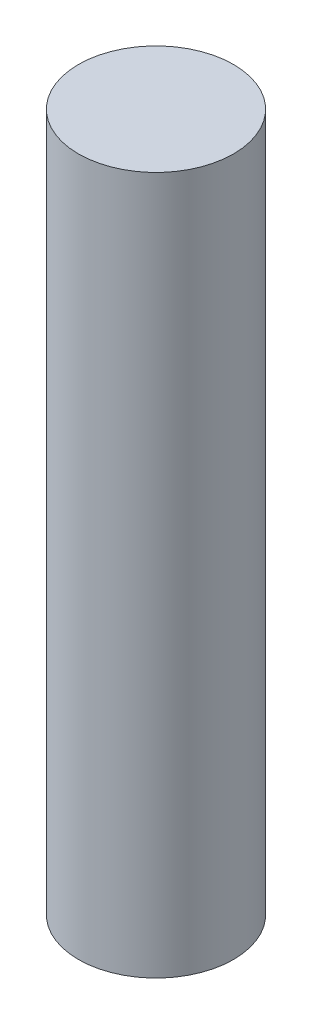
ISO-10303-21;
HEADER;
FILE_DESCRIPTION(('STEP AP214'),'2;1');
FILE_NAME('part.step','',(''),(''),'','','');
FILE_SCHEMA(('AUTOMOTIVE_DESIGN { 1 0 10303 214 1 1 1 1 }'));
ENDSEC;
DATA;
#1=APPLICATION_CONTEXT('core data for automotive mechanical design processes');
#2=APPLICATION_PROTOCOL_DEFINITION('international standard','automotive_design',2000,#1);
#3=PRODUCT_CONTEXT('',#1,'mechanical');
#4=PRODUCT('Part','Part','',(#3));
#5=PRODUCT_RELATED_PRODUCT_CATEGORY('part','',(#4));
#6=PRODUCT_DEFINITION_FORMATION('','',#4);
#7=PRODUCT_DEFINITION_CONTEXT('part definition',#1,'design');
#8=PRODUCT_DEFINITION('design','',#6,#7);
#9=PRODUCT_DEFINITION_SHAPE('','',#8);
#10=(LENGTH_UNIT() NAMED_UNIT(*) SI_UNIT(.MILLI.,.METRE.));
#11=(NAMED_UNIT(*) PLANE_ANGLE_UNIT() SI_UNIT($,.RADIAN.));
#12=(NAMED_UNIT(*) SI_UNIT($,.STERADIAN.) SOLID_ANGLE_UNIT());
#13=UNCERTAINTY_MEASURE_WITH_UNIT(LENGTH_MEASURE(1.E-05),#10,'distance_accuracy_value','');
#14=(GEOMETRIC_REPRESENTATION_CONTEXT(3) GLOBAL_UNCERTAINTY_ASSIGNED_CONTEXT((#13)) GLOBAL_UNIT_ASSIGNED_CONTEXT((#10,
#11,#12)) REPRESENTATION_CONTEXT('',''));
#15=CARTESIAN_POINT('',(0.,0.,0.));
#16=DIRECTION('',(0.,0.,1.));
#17=DIRECTION('',(1.,0.,0.));
#18=AXIS2_PLACEMENT_3D('',#15,#16,#17);
#19=CARTESIAN_POINT('',(0.,114.3,0.));
#20=DIRECTION('',(0.,-1.,0.));
#21=DIRECTION('',(0.,0.,-1.));
#22=AXIS2_PLACEMENT_3D('',#19,#20,#21);
#23=CYLINDRICAL_SURFACE('',#22,12.7);
#24=CARTESIAN_POINT('',(0.,114.3,0.));
#25=DIRECTION('',(0.,1.,0.));
#26=DIRECTION('',(0.,0.,1.));
#27=AXIS2_PLACEMENT_3D('',#24,#25,#26);
#28=CIRCLE('',#27,12.7);
#29=CARTESIAN_POINT('',(0.,114.3,12.7));
#30=VERTEX_POINT('',#29);
#31=EDGE_CURVE('E10',#30,#30,#28,.T.);
#32=ORIENTED_EDGE('',*,*,#31,.F.);
#33=EDGE_LOOP('',(#32));
#34=FACE_BOUND('',#33,.T.);
#35=CARTESIAN_POINT('',(0.,0.,0.));
#36=DIRECTION('',(0.,1.,0.));
#37=DIRECTION('',(0.,0.,1.));
#38=AXIS2_PLACEMENT_3D('',#35,#36,#37);
#39=CIRCLE('',#38,12.7);
#40=CARTESIAN_POINT('',(0.,0.,12.7));
#41=VERTEX_POINT('',#40);
#42=EDGE_CURVE('E44',#41,#41,#39,.T.);
#43=ORIENTED_EDGE('',*,*,#42,.T.);
#44=EDGE_LOOP('',(#43));
#45=FACE_BOUND('',#44,.T.);
#46=ADVANCED_FACE('F41',(#34,#45),#23,.T.);
#47=CARTESIAN_POINT('',(0.,114.3,0.));
#48=DIRECTION('',(0.,1.,0.));
#49=DIRECTION('',(0.,0.,1.));
#50=AXIS2_PLACEMENT_3D('',#47,#48,#49);
#51=PLANE('',#50);
#52=ORIENTED_EDGE('',*,*,#31,.T.);
#53=EDGE_LOOP('',(#52));
#54=FACE_BOUND('',#53,.T.);
#55=ADVANCED_FACE('F58',(#54),#51,.T.);
#56=CARTESIAN_POINT('',(0.,0.,0.));
#57=DIRECTION('',(0.,1.,0.));
#58=DIRECTION('',(0.,0.,1.));
#59=AXIS2_PLACEMENT_3D('',#56,#57,#58);
#60=PLANE('',#59);
#61=ORIENTED_EDGE('',*,*,#42,.F.);
#62=EDGE_LOOP('',(#61));
#63=FACE_BOUND('',#62,.T.);
#64=ADVANCED_FACE('F56',(#63),#60,.F.);
#65=CLOSED_SHELL('',(#46,#55,#64));
#66=MANIFOLD_SOLID_BREP('B2',#65);
#67=ADVANCED_BREP_SHAPE_REPRESENTATION('',(#18,#66),#14);
#68=SHAPE_DEFINITION_REPRESENTATION(#9,#67);
ENDSEC;
END-ISO-10303-21;
